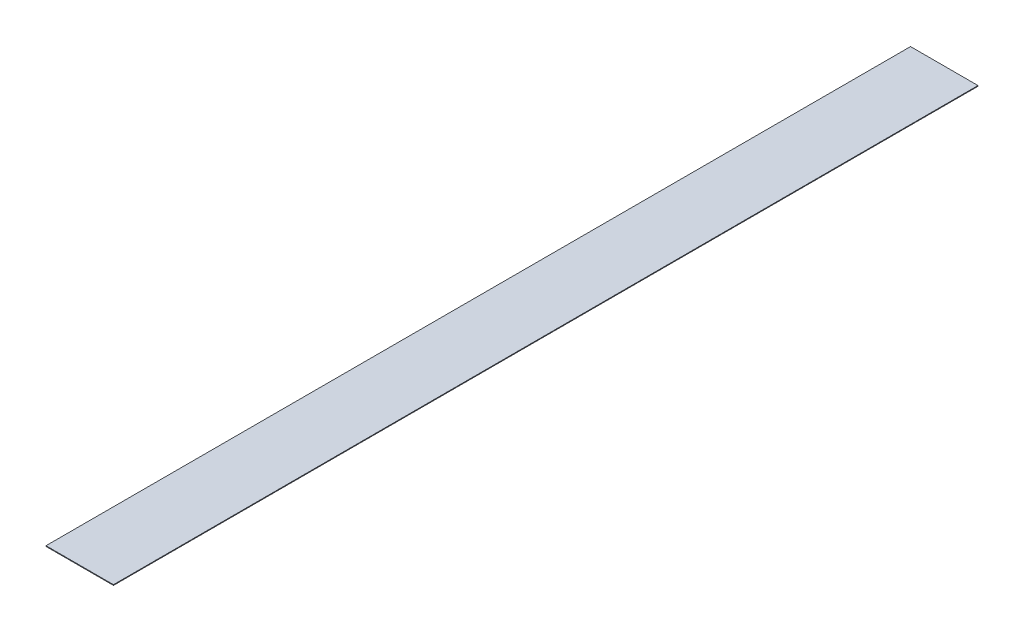
ISO-10303-21;
HEADER;
FILE_DESCRIPTION(('STEP AP214'),'2;1');
FILE_NAME('part.step','',(''),(''),'','','');
FILE_SCHEMA(('AUTOMOTIVE_DESIGN { 1 0 10303 214 1 1 1 1 }'));
ENDSEC;
DATA;
#1=APPLICATION_CONTEXT('core data for automotive mechanical design processes');
#2=APPLICATION_PROTOCOL_DEFINITION('international standard','automotive_design',2000,#1);
#3=PRODUCT_CONTEXT('',#1,'mechanical');
#4=PRODUCT('Part','Part','',(#3));
#5=PRODUCT_RELATED_PRODUCT_CATEGORY('part','',(#4));
#6=PRODUCT_DEFINITION_FORMATION('','',#4);
#7=PRODUCT_DEFINITION_CONTEXT('part definition',#1,'design');
#8=PRODUCT_DEFINITION('design','',#6,#7);
#9=PRODUCT_DEFINITION_SHAPE('','',#8);
#10=(LENGTH_UNIT() NAMED_UNIT(*) SI_UNIT(.MILLI.,.METRE.));
#11=(NAMED_UNIT(*) PLANE_ANGLE_UNIT() SI_UNIT($,.RADIAN.));
#12=(NAMED_UNIT(*) SI_UNIT($,.STERADIAN.) SOLID_ANGLE_UNIT());
#13=UNCERTAINTY_MEASURE_WITH_UNIT(LENGTH_MEASURE(1.E-05),#10,'distance_accuracy_value','');
#14=(GEOMETRIC_REPRESENTATION_CONTEXT(3) GLOBAL_UNCERTAINTY_ASSIGNED_CONTEXT((#13)) GLOBAL_UNIT_ASSIGNED_CONTEXT((#10,
#11,#12)) REPRESENTATION_CONTEXT('',''));
#15=CARTESIAN_POINT('',(0.,0.,0.));
#16=DIRECTION('',(0.,0.,1.));
#17=DIRECTION('',(1.,0.,0.));
#18=AXIS2_PLACEMENT_3D('',#15,#16,#17);
#19=CARTESIAN_POINT('',(-25.4,0.508,0.));
#20=DIRECTION('',(1.,0.,0.));
#21=DIRECTION('',(0.,0.,-1.));
#22=AXIS2_PLACEMENT_3D('',#19,#20,#21);
#23=PLANE('',#22);
#24=DIRECTION('',(0.,0.,1.));
#25=VECTOR('',#24,1.);
#26=CARTESIAN_POINT('',(-25.4,0.,0.));
#27=LINE('',#26,#25);
#28=CARTESIAN_POINT('',(-25.4,0.,-650.875));
#29=VERTEX_POINT('',#28);
#30=CARTESIAN_POINT('',(-25.4,0.,0.));
#31=VERTEX_POINT('',#30);
#32=EDGE_CURVE('E96',#29,#31,#27,.T.);
#33=ORIENTED_EDGE('',*,*,#32,.T.);
#34=DIRECTION('',(0.,-1.,0.));
#35=VECTOR('',#34,1.);
#36=CARTESIAN_POINT('',(-25.4,0.508,0.));
#37=LINE('',#36,#35);
#38=CARTESIAN_POINT('',(-25.4,0.508,0.));
#39=VERTEX_POINT('',#38);
#40=EDGE_CURVE('E11',#39,#31,#37,.T.);
#41=ORIENTED_EDGE('',*,*,#40,.F.);
#42=DIRECTION('',(0.,0.,1.));
#43=VECTOR('',#42,1.);
#44=CARTESIAN_POINT('',(-25.4,0.508,0.));
#45=LINE('',#44,#43);
#46=CARTESIAN_POINT('',(-25.4,0.508,-650.875));
#47=VERTEX_POINT('',#46);
#48=EDGE_CURVE('E84',#47,#39,#45,.T.);
#49=ORIENTED_EDGE('',*,*,#48,.F.);
#50=DIRECTION('',(0.,-1.,0.));
#51=VECTOR('',#50,1.);
#52=CARTESIAN_POINT('',(-25.4,0.508,-650.875));
#53=LINE('',#52,#51);
#54=EDGE_CURVE('E92',#47,#29,#53,.T.);
#55=ORIENTED_EDGE('',*,*,#54,.T.);
#56=EDGE_LOOP('',(#33,#41,#49,#55));
#57=FACE_BOUND('',#56,.T.);
#58=ADVANCED_FACE('F33',(#57),#23,.F.);
#59=CARTESIAN_POINT('',(-25.4,0.508,0.));
#60=DIRECTION('',(0.,0.,-1.));
#61=DIRECTION('',(-1.,0.,0.));
#62=AXIS2_PLACEMENT_3D('',#59,#60,#61);
#63=PLANE('',#62);
#64=DIRECTION('',(1.,0.,0.));
#65=VECTOR('',#64,1.);
#66=CARTESIAN_POINT('',(-25.4,0.,0.));
#67=LINE('',#66,#65);
#68=CARTESIAN_POINT('',(25.4,0.,0.));
#69=VERTEX_POINT('',#68);
#70=EDGE_CURVE('E88',#31,#69,#67,.T.);
#71=ORIENTED_EDGE('',*,*,#70,.T.);
#72=DIRECTION('',(0.,-1.,0.));
#73=VECTOR('',#72,1.);
#74=CARTESIAN_POINT('',(25.4,0.508,0.));
#75=LINE('',#74,#73);
#76=CARTESIAN_POINT('',(25.4,0.508,0.));
#77=VERTEX_POINT('',#76);
#78=EDGE_CURVE('E41',#77,#69,#75,.T.);
#79=ORIENTED_EDGE('',*,*,#78,.F.);
#80=DIRECTION('',(1.,0.,0.));
#81=VECTOR('',#80,1.);
#82=CARTESIAN_POINT('',(-25.4,0.508,0.));
#83=LINE('',#82,#81);
#84=EDGE_CURVE('E79',#39,#77,#83,.T.);
#85=ORIENTED_EDGE('',*,*,#84,.F.);
#86=ORIENTED_EDGE('',*,*,#40,.T.);
#87=EDGE_LOOP('',(#71,#79,#85,#86));
#88=FACE_BOUND('',#87,.T.);
#89=ADVANCED_FACE('F87',(#88),#63,.F.);
#90=CARTESIAN_POINT('',(25.4,0.508,0.));
#91=DIRECTION('',(-1.,0.,0.));
#92=DIRECTION('',(0.,0.,1.));
#93=AXIS2_PLACEMENT_3D('',#90,#91,#92);
#94=PLANE('',#93);
#95=DIRECTION('',(0.,0.,-1.));
#96=VECTOR('',#95,1.);
#97=CARTESIAN_POINT('',(25.4,0.,0.));
#98=LINE('',#97,#96);
#99=CARTESIAN_POINT('',(25.4,0.,-650.875));
#100=VERTEX_POINT('',#99);
#101=EDGE_CURVE('E66',#69,#100,#98,.T.);
#102=ORIENTED_EDGE('',*,*,#101,.T.);
#103=DIRECTION('',(0.,-1.,0.));
#104=VECTOR('',#103,1.);
#105=CARTESIAN_POINT('',(25.4,0.508,-650.875));
#106=LINE('',#105,#104);
#107=CARTESIAN_POINT('',(25.4,0.508,-650.875));
#108=VERTEX_POINT('',#107);
#109=EDGE_CURVE('E89',#108,#100,#106,.T.);
#110=ORIENTED_EDGE('',*,*,#109,.F.);
#111=DIRECTION('',(0.,0.,-1.));
#112=VECTOR('',#111,1.);
#113=CARTESIAN_POINT('',(25.4,0.508,0.));
#114=LINE('',#113,#112);
#115=EDGE_CURVE('E82',#77,#108,#114,.T.);
#116=ORIENTED_EDGE('',*,*,#115,.F.);
#117=ORIENTED_EDGE('',*,*,#78,.T.);
#118=EDGE_LOOP('',(#102,#110,#116,#117));
#119=FACE_BOUND('',#118,.T.);
#120=ADVANCED_FACE('F90',(#119),#94,.F.);
#121=CARTESIAN_POINT('',(-25.4,0.508,-650.875));
#122=DIRECTION('',(0.,0.,1.));
#123=DIRECTION('',(1.,0.,0.));
#124=AXIS2_PLACEMENT_3D('',#121,#122,#123);
#125=PLANE('',#124);
#126=DIRECTION('',(-1.,0.,0.));
#127=VECTOR('',#126,1.);
#128=CARTESIAN_POINT('',(-25.4,0.,-650.875));
#129=LINE('',#128,#127);
#130=EDGE_CURVE('E72',#100,#29,#129,.T.);
#131=ORIENTED_EDGE('',*,*,#130,.T.);
#132=ORIENTED_EDGE('',*,*,#54,.F.);
#133=DIRECTION('',(-1.,0.,0.));
#134=VECTOR('',#133,1.);
#135=CARTESIAN_POINT('',(-25.4,0.508,-650.875));
#136=LINE('',#135,#134);
#137=EDGE_CURVE('E49',#108,#47,#136,.T.);
#138=ORIENTED_EDGE('',*,*,#137,.F.);
#139=ORIENTED_EDGE('',*,*,#109,.T.);
#140=EDGE_LOOP('',(#131,#132,#138,#139));
#141=FACE_BOUND('',#140,.T.);
#142=ADVANCED_FACE('F103',(#141),#125,.F.);
#143=CARTESIAN_POINT('',(0.,0.508,0.));
#144=DIRECTION('',(0.,-1.,0.));
#145=DIRECTION('',(0.,0.,-1.));
#146=AXIS2_PLACEMENT_3D('',#143,#144,#145);
#147=PLANE('',#146);
#148=ORIENTED_EDGE('',*,*,#48,.T.);
#149=ORIENTED_EDGE('',*,*,#84,.T.);
#150=ORIENTED_EDGE('',*,*,#115,.T.);
#151=ORIENTED_EDGE('',*,*,#137,.T.);
#152=EDGE_LOOP('',(#148,#149,#150,#151));
#153=FACE_BOUND('',#152,.T.);
#154=ADVANCED_FACE('F80',(#153),#147,.F.);
#155=CARTESIAN_POINT('',(0.,0.,0.));
#156=DIRECTION('',(0.,-1.,0.));
#157=DIRECTION('',(0.,0.,-1.));
#158=AXIS2_PLACEMENT_3D('',#155,#156,#157);
#159=PLANE('',#158);
#160=ORIENTED_EDGE('',*,*,#32,.F.);
#161=ORIENTED_EDGE('',*,*,#130,.F.);
#162=ORIENTED_EDGE('',*,*,#101,.F.);
#163=ORIENTED_EDGE('',*,*,#70,.F.);
#164=EDGE_LOOP('',(#160,#161,#162,#163));
#165=FACE_BOUND('',#164,.T.);
#166=ADVANCED_FACE('F106',(#165),#159,.T.);
#167=CLOSED_SHELL('',(#58,#89,#120,#142,#154,#166));
#168=MANIFOLD_SOLID_BREP('B2',#167);
#169=ADVANCED_BREP_SHAPE_REPRESENTATION('',(#18,#168),#14);
#170=SHAPE_DEFINITION_REPRESENTATION(#9,#169);
ENDSEC;
END-ISO-10303-21;
